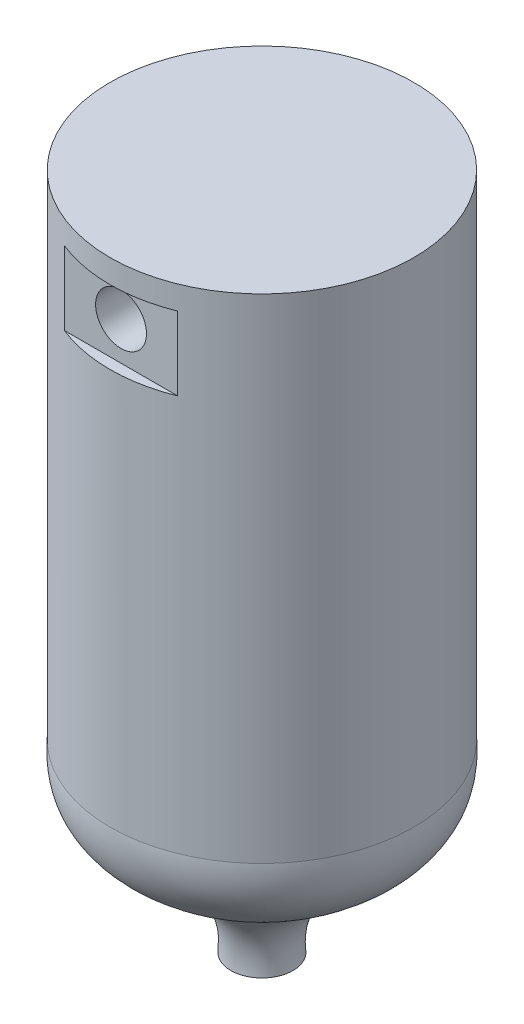
ISO-10303-21;
HEADER;
FILE_DESCRIPTION(('STEP AP214'),'2;1');
FILE_NAME('part.step','',(''),(''),'','','');
FILE_SCHEMA(('AUTOMOTIVE_DESIGN { 1 0 10303 214 1 1 1 1 }'));
ENDSEC;
DATA;
#1=APPLICATION_CONTEXT('core data for automotive mechanical design processes');
#2=APPLICATION_PROTOCOL_DEFINITION('international standard','automotive_design',2000,#1);
#3=PRODUCT_CONTEXT('',#1,'mechanical');
#4=PRODUCT('Part','Part','',(#3));
#5=PRODUCT_RELATED_PRODUCT_CATEGORY('part','',(#4));
#6=PRODUCT_DEFINITION_FORMATION('','',#4);
#7=PRODUCT_DEFINITION_CONTEXT('part definition',#1,'design');
#8=PRODUCT_DEFINITION('design','',#6,#7);
#9=PRODUCT_DEFINITION_SHAPE('','',#8);
#10=(LENGTH_UNIT() NAMED_UNIT(*) SI_UNIT(.MILLI.,.METRE.));
#11=(NAMED_UNIT(*) PLANE_ANGLE_UNIT() SI_UNIT($,.RADIAN.));
#12=(NAMED_UNIT(*) SI_UNIT($,.STERADIAN.) SOLID_ANGLE_UNIT());
#13=UNCERTAINTY_MEASURE_WITH_UNIT(LENGTH_MEASURE(1.E-05),#10,'distance_accuracy_value','');
#14=(GEOMETRIC_REPRESENTATION_CONTEXT(3) GLOBAL_UNCERTAINTY_ASSIGNED_CONTEXT((#13)) GLOBAL_UNIT_ASSIGNED_CONTEXT((#10,
#11,#12)) REPRESENTATION_CONTEXT('',''));
#15=CARTESIAN_POINT('',(0.,0.,0.));
#16=DIRECTION('',(0.,0.,1.));
#17=DIRECTION('',(1.,0.,0.));
#18=AXIS2_PLACEMENT_3D('',#15,#16,#17);
#19=CARTESIAN_POINT('',(0.,0.,0.));
#20=DIRECTION('',(0.,1.,0.));
#21=DIRECTION('',(0.,0.,1.));
#22=AXIS2_PLACEMENT_3D('',#19,#20,#21);
#23=CYLINDRICAL_SURFACE('',#22,3.87911139565885);
#24=CARTESIAN_POINT('',(-0.65,-1.5,-3.82426531766957));
#25=CARTESIAN_POINT('',(-0.649998546176578,-1.53623473371001,-3.82426597421118));
#26=CARTESIAN_POINT('',(-0.646959839982097,-1.5724891832765,-3.82478588320797));
#27=CARTESIAN_POINT('',(-0.634890704729489,-1.64398064009959,-3.82680741958481));
#28=CARTESIAN_POINT('',(-0.625854768136324,-1.67921668103609,-3.82830994933251));
#29=CARTESIAN_POINT('',(-0.602072361174586,-1.74762634232507,-3.83212188225558));
#30=CARTESIAN_POINT('',(-0.587330685552948,-1.78080166728235,-3.83443060779544));
#31=CARTESIAN_POINT('',(-0.552567234311796,-1.84420451847038,-3.83959399553368));
#32=CARTESIAN_POINT('',(-0.532546045399725,-1.87443237173998,-3.84244859705967));
#33=CARTESIAN_POINT('',(-0.487579135023968,-1.93138691220626,-3.84841387152831));
#34=CARTESIAN_POINT('',(-0.462591092558456,-1.95807997521595,-3.85152660092203));
#35=CARTESIAN_POINT('',(-0.408491251125715,-2.0069151286747,-3.85763914063868));
#36=CARTESIAN_POINT('',(-0.379379206890013,-2.02905694825366,-3.86063894423208));
#37=CARTESIAN_POINT('',(-0.317639762197346,-2.06828739288232,-3.8662094076632));
#38=CARTESIAN_POINT('',(-0.284992202508499,-2.08534470815015,-3.86877736772152));
#39=CARTESIAN_POINT('',(-0.217244981977225,-2.11372068228962,-3.87317191464372));
#40=CARTESIAN_POINT('',(-0.182145482450684,-2.1250397182853,-3.87499855022643));
#41=CARTESIAN_POINT('',(-0.11083815247847,-2.14151494195452,-3.87769011834452));
#42=CARTESIAN_POINT('',(-0.0746437147454618,-2.14672763225848,-3.8785638627805));
#43=CARTESIAN_POINT('',(-0.00188412118006963,-2.15101790919141,-3.87928148049109));
#44=CARTESIAN_POINT('',(0.0346810090221711,-2.15009591713017,-3.87912542448902));
#45=CARTESIAN_POINT('',(0.106757666444681,-2.14218703581793,-3.87780799655712));
#46=CARTESIAN_POINT('',(0.142276076778854,-2.13526095571873,-3.87665670466136));
#47=CARTESIAN_POINT('',(0.211639336783039,-2.11563627429322,-3.87348940750765));
#48=CARTESIAN_POINT('',(0.245484135016727,-2.10293749567252,-3.87147337569143));
#49=CARTESIAN_POINT('',(0.310720102129918,-2.07206755754787,-3.8667859737859));
#50=CARTESIAN_POINT('',(0.342099205212783,-2.0538713719186,-3.86411161730821));
#51=CARTESIAN_POINT('',(0.401381543998368,-2.0125414822751,-3.85840463427098));
#52=CARTESIAN_POINT('',(0.429284495121526,-1.98940737443176,-3.85537197841837));
#53=CARTESIAN_POINT('',(0.481181784451118,-1.9385211503054,-3.84924171525799));
#54=CARTESIAN_POINT('',(0.505123997622087,-1.91071588440319,-3.84614376750001));
#55=CARTESIAN_POINT('',(0.548011596283445,-1.85145563228404,-3.84026802874931));
#56=CARTESIAN_POINT('',(0.566956934711448,-1.82000061169641,-3.83749024077211));
#57=CARTESIAN_POINT('',(0.59932343229095,-1.75427293543053,-3.83256914548439));
#58=CARTESIAN_POINT('',(0.612738262213018,-1.71999710505323,-3.8304265659026));
#59=CARTESIAN_POINT('',(0.633605346199086,-1.64963461682606,-3.82703048537092));
#60=CARTESIAN_POINT('',(0.641058131300565,-1.61354812055598,-3.82577690523927));
#61=CARTESIAN_POINT('',(0.649716058915203,-1.54105519312155,-3.82431609196514));
#62=CARTESIAN_POINT('',(0.650995530089509,-1.50465788188375,-3.82409641114238));
#63=CARTESIAN_POINT('',(0.647468632171978,-1.43216918617923,-3.82469510794848));
#64=CARTESIAN_POINT('',(0.642662500792468,-1.39607778981846,-3.82551344503088));
#65=CARTESIAN_POINT('',(0.627164216746416,-1.32546187391059,-3.82808446713303));
#66=CARTESIAN_POINT('',(0.616509944555507,-1.29092880222565,-3.82983113672897));
#67=CARTESIAN_POINT('',(0.589657562320541,-1.22413826902969,-3.83405696439789));
#68=CARTESIAN_POINT('',(0.573459117414842,-1.19188094511318,-3.83653616671377));
#69=CARTESIAN_POINT('',(0.535802955875207,-1.13022690615426,-3.84197661496759));
#70=CARTESIAN_POINT('',(0.514297635171476,-1.10085965022917,-3.84494213773607));
#71=CARTESIAN_POINT('',(0.466703470604773,-1.04612403662627,-3.85100859694524));
#72=CARTESIAN_POINT('',(0.440614300737223,-1.02075596361505,-3.85410954300549));
#73=CARTESIAN_POINT('',(0.384263596041511,-0.974467147017902,-3.86013684859037));
#74=CARTESIAN_POINT('',(0.353961060199368,-0.95359599000505,-3.86306102861043));
#75=CARTESIAN_POINT('',(0.290236629098992,-0.917240896396043,-3.86837028889656));
#76=CARTESIAN_POINT('',(0.256814835626906,-0.901756784090276,-3.87075538674502));
#77=CARTESIAN_POINT('',(0.187947500666159,-0.876692360808176,-3.87470827765538));
#78=CARTESIAN_POINT('',(0.152511593586471,-0.867086166794153,-3.87627964913628));
#79=CARTESIAN_POINT('',(0.0805010077226178,-0.853966950934267,-3.87844317038438));
#80=CARTESIAN_POINT('',(0.0439264239525057,-0.850453422080832,-3.87903540163158));
#81=CARTESIAN_POINT('',(-0.0288448197955339,-0.849633987644511,-3.87917274316738));
#82=CARTESIAN_POINT('',(-0.065040628603624,-0.852252657431067,-3.87873057638042));
#83=CARTESIAN_POINT('',(-0.136469124605742,-0.863460061871194,-3.87687479645365));
#84=CARTESIAN_POINT('',(-0.171701817334256,-0.872048762210858,-3.87546118889738));
#85=CARTESIAN_POINT('',(-0.240174698817801,-0.894923364312018,-3.8718208257365));
#86=CARTESIAN_POINT('',(-0.27341710438651,-0.909202786565537,-3.86959499517873));
#87=CARTESIAN_POINT('',(-0.337045844962254,-0.943045067938054,-3.86457308340457));
#88=CARTESIAN_POINT('',(-0.367432042124925,-0.96260818187864,-3.86177697468642));
#89=CARTESIAN_POINT('',(-0.424865594236063,-1.00672958960788,-3.85588364724219));
#90=CARTESIAN_POINT('',(-0.451870227296492,-1.03134308560145,-3.85278331758001));
#91=CARTESIAN_POINT('',(-0.501392558411011,-1.08475077605094,-3.84665243719653));
#92=CARTESIAN_POINT('',(-0.523909204011142,-1.11354594839926,-3.8436219029896));
#93=CARTESIAN_POINT('',(-0.56396465040941,-1.17474445534734,-3.83795029257064));
#94=CARTESIAN_POINT('',(-0.581466661720417,-1.20717214444206,-3.83531215973278));
#95=CARTESIAN_POINT('',(-0.610748083636937,-1.27453835627387,-3.83075886050394));
#96=CARTESIAN_POINT('',(-0.62253319835938,-1.30947433619423,-3.82884297390852));
#97=CARTESIAN_POINT('',(-0.637493507166445,-1.37045422319241,-3.82637495290772));
#98=CARTESIAN_POINT('',(-0.642175896650694,-1.39612937215403,-3.82558825072897));
#99=CARTESIAN_POINT('',(-0.648429637356514,-1.4478662830633,-3.82453320169885));
#100=CARTESIAN_POINT('',(-0.650001046068933,-1.4739280378575,-3.82426484526847));
#101=CARTESIAN_POINT('',(-0.65,-1.5,-3.82426531766957));
#102=B_SPLINE_CURVE_WITH_KNOTS('',3,(#24,#25,#26,#27,#28,#29,#30,#31,#32,#33,#34,#35,#36,#37,
#38,#39,#40,#41,#42,#43,#44,#45,#46,#47,#48,#49,#50,#51,#52,#53,#54,#55,#56,#57,#58,#59,#60,#61,
#62,#63,#64,#65,#66,#67,#68,#69,#70,#71,#72,#73,#74,#75,#76,#77,#78,#79,#80,#81,#82,#83,#84,#85,
#86,#87,#88,#89,#90,#91,#92,#93,#94,#95,#96,#97,#98,#99,#100,#101),.UNSPECIFIED.,.T.,.F.,(4,2,2,
2,2,2,2,2,2,2,2,2,2,2,2,2,2,2,2,2,2,2,2,2,2,2,2,2,2,2,2,2,2,2,2,2,2,2,4),(0.,0.108608857730518,
0.21731759427881,0.325935176437261,0.434540693107146,0.544114666275385,0.653695158920189,
0.763937120614878,0.874171836184982,0.983378273650201,1.09257721125403,1.2006829391961,
1.30879198756683,1.41740079799347,1.52601849398249,1.63596811289193,1.74591876730993,
1.85599490457998,1.96606123631073,2.07479896994673,2.18353245626258,2.29156980913198,
2.39961368848482,2.5086644211308,2.61772291263577,2.72792854999,2.83813059242224,
2.94784380777978,3.05754789279791,3.16590974263105,3.27427096963861,3.382509166465,
3.49075258432957,3.60024901689767,3.70977109675673,3.82007722636633,3.9302730688868,
4.00842179711966,4.08656908115248),.UNSPECIFIED.);
#103=CARTESIAN_POINT('',(-0.65,-1.5,-3.82426531766957));
#104=VERTEX_POINT('',#103);
#105=EDGE_CURVE('E77',#104,#104,#102,.T.);
#106=ORIENTED_EDGE('',*,*,#105,.T.);
#107=EDGE_LOOP('',(#106));
#108=FACE_BOUND('',#107,.T.);
#109=CARTESIAN_POINT('',(0.,-12.6027502968154,0.));
#110=DIRECTION('',(0.,1.,0.));
#111=DIRECTION('',(0.,0.,1.));
#112=AXIS2_PLACEMENT_3D('',#109,#110,#111);
#113=CIRCLE('',#112,3.87911140215357);
#114=CARTESIAN_POINT('',(0.,-12.6027502968154,3.87911140215357));
#115=VERTEX_POINT('',#114);
#116=EDGE_CURVE('E119',#115,#115,#113,.T.);
#117=ORIENTED_EDGE('',*,*,#116,.T.);
#118=EDGE_LOOP('',(#117));
#119=FACE_BOUND('',#118,.T.);
#120=CARTESIAN_POINT('',(0.,0.,0.));
#121=DIRECTION('',(0.,1.,0.));
#122=DIRECTION('',(0.,0.,1.));
#123=AXIS2_PLACEMENT_3D('',#120,#121,#122);
#124=CIRCLE('',#123,3.87911139565885);
#125=CARTESIAN_POINT('',(0.,0.,3.87911139565885));
#126=VERTEX_POINT('',#125);
#127=EDGE_CURVE('E84',#126,#126,#124,.T.);
#128=ORIENTED_EDGE('',*,*,#127,.F.);
#129=EDGE_LOOP('',(#128));
#130=FACE_BOUND('',#129,.T.);
#131=DIRECTION('',(0.,1.,0.));
#132=VECTOR('',#131,1.);
#133=CARTESIAN_POINT('',(1.44545064489807,0.,3.59974688736501));
#134=LINE('',#133,#132);
#135=CARTESIAN_POINT('',(1.44545064489807,-0.59983719010951,3.59974688736501));
#136=VERTEX_POINT('',#135);
#137=CARTESIAN_POINT('',(1.44545064489807,-2.47625754011222,3.59974688736501));
#138=VERTEX_POINT('',#137);
#139=EDGE_CURVE('E70',#136,#138,#134,.F.);
#140=ORIENTED_EDGE('',*,*,#139,.T.);
#141=CARTESIAN_POINT('',(0.,-2.47625754011222,0.));
#142=DIRECTION('',(0.,1.,0.));
#143=DIRECTION('',(0.,0.,1.));
#144=AXIS2_PLACEMENT_3D('',#141,#142,#143);
#145=CIRCLE('',#144,3.87911139565885);
#146=CARTESIAN_POINT('',(-1.44545064489807,-2.47625754011222,3.59974688736501));
#147=VERTEX_POINT('',#146);
#148=EDGE_CURVE('E11',#138,#147,#145,.F.);
#149=ORIENTED_EDGE('',*,*,#148,.T.);
#150=DIRECTION('',(0.,1.,0.));
#151=VECTOR('',#150,1.);
#152=CARTESIAN_POINT('',(-1.44545064489807,0.,3.59974688736501));
#153=LINE('',#152,#151);
#154=CARTESIAN_POINT('',(-1.44545064489807,-0.59983719010951,3.59974688736501));
#155=VERTEX_POINT('',#154);
#156=EDGE_CURVE('E71',#147,#155,#153,.T.);
#157=ORIENTED_EDGE('',*,*,#156,.T.);
#158=CARTESIAN_POINT('',(0.,-0.59983719010951,0.));
#159=DIRECTION('',(0.,-1.,0.));
#160=DIRECTION('',(0.,0.,-1.));
#161=AXIS2_PLACEMENT_3D('',#158,#159,#160);
#162=CIRCLE('',#161,3.87911139565885);
#163=EDGE_CURVE('E44',#155,#136,#162,.F.);
#164=ORIENTED_EDGE('',*,*,#163,.T.);
#165=EDGE_LOOP('',(#140,#149,#157,#164));
#166=FACE_BOUND('',#165,.T.);
#167=ADVANCED_FACE('F36',(#108,#119,#130,#166),#23,.T.);
#168=CARTESIAN_POINT('',(-3.87911139565885,0.,0.));
#169=DIRECTION('',(0.,1.,0.));
#170=DIRECTION('',(0.,0.,1.));
#171=AXIS2_PLACEMENT_3D('',#168,#169,#170);
#172=PLANE('',#171);
#173=ORIENTED_EDGE('',*,*,#127,.T.);
#174=EDGE_LOOP('',(#173));
#175=FACE_BOUND('',#174,.T.);
#176=ADVANCED_FACE('F38',(#175),#172,.T.);
#177=CARTESIAN_POINT('',(-0.795067133024361,-17.316571149834,0.));
#178=DIRECTION('',(0.,-1.,0.));
#179=DIRECTION('',(0.,0.,-1.));
#180=AXIS2_PLACEMENT_3D('',#177,#178,#179);
#181=PLANE('',#180);
#182=CARTESIAN_POINT('',(0.,-17.316571149834,0.));
#183=DIRECTION('',(0.,1.,0.));
#184=DIRECTION('',(0.,0.,1.));
#185=AXIS2_PLACEMENT_3D('',#182,#183,#184);
#186=CIRCLE('',#185,0.795067133024361);
#187=CARTESIAN_POINT('',(0.,-17.316571149834,0.795067133024361));
#188=VERTEX_POINT('',#187);
#189=EDGE_CURVE('E122',#188,#188,#186,.T.);
#190=ORIENTED_EDGE('',*,*,#189,.F.);
#191=EDGE_LOOP('',(#190));
#192=FACE_BOUND('',#191,.T.);
#193=ADVANCED_FACE('F98',(#192),#181,.T.);
#194=CARTESIAN_POINT('',(-3.87911140215357,-12.6027502968154,0.));
#195=CARTESIAN_POINT('',(-4.09623859330577,-15.2491800405902,0.));
#196=CARTESIAN_POINT('',(-0.537349983631471,-14.7278090992826,0.));
#197=CARTESIAN_POINT('',(-0.795067133024361,-17.316571149834,0.));
#198=B_SPLINE_CURVE_WITH_KNOTS('',3,(#194,#195,#196,#197),.UNSPECIFIED.,.F.,.F.,(4,4),(0.,1.),.UNSPECIFIED.);
#199=CARTESIAN_POINT('',(0.,0.,0.));
#200=DIRECTION('',(0.,1.,0.));
#201=AXIS1_PLACEMENT('',#199,#200);
#202=SURFACE_OF_REVOLUTION('',#198,#201);
#203=ORIENTED_EDGE('',*,*,#189,.T.);
#204=EDGE_LOOP('',(#203));
#205=FACE_BOUND('',#204,.T.);
#206=ORIENTED_EDGE('',*,*,#116,.F.);
#207=EDGE_LOOP('',(#206));
#208=FACE_BOUND('',#207,.T.);
#209=ADVANCED_FACE('F94',(#205,#208),#202,.F.);
#210=CARTESIAN_POINT('',(0.,-1.5,-1.9));
#211=DIRECTION('',(0.,0.,-1.));
#212=DIRECTION('',(-1.,0.,0.));
#213=AXIS2_PLACEMENT_3D('',#210,#211,#212);
#214=CYLINDRICAL_SURFACE('',#213,0.65);
#215=ORIENTED_EDGE('',*,*,#105,.F.);
#216=EDGE_LOOP('',(#215));
#217=FACE_BOUND('',#216,.T.);
#218=CARTESIAN_POINT('',(0.,-1.5,-1.9));
#219=DIRECTION('',(0.,0.,1.));
#220=DIRECTION('',(1.,0.,0.));
#221=AXIS2_PLACEMENT_3D('',#218,#219,#220);
#222=CIRCLE('',#221,0.65);
#223=CARTESIAN_POINT('',(0.65,-1.5,-1.9));
#224=VERTEX_POINT('',#223);
#225=EDGE_CURVE('E74',#224,#224,#222,.T.);
#226=ORIENTED_EDGE('',*,*,#225,.T.);
#227=EDGE_LOOP('',(#226));
#228=FACE_BOUND('',#227,.T.);
#229=ADVANCED_FACE('F97',(#217,#228),#214,.F.);
#230=CARTESIAN_POINT('',(0.,-1.5,-1.9));
#231=DIRECTION('',(0.,0.,1.));
#232=DIRECTION('',(1.,0.,0.));
#233=AXIS2_PLACEMENT_3D('',#230,#231,#232);
#234=PLANE('',#233);
#235=ORIENTED_EDGE('',*,*,#225,.F.);
#236=EDGE_LOOP('',(#235));
#237=FACE_BOUND('',#236,.T.);
#238=ADVANCED_FACE('F135',(#237),#234,.F.);
#239=CARTESIAN_POINT('',(5.,-2.47625754011222,3.59974688736501));
#240=DIRECTION('',(0.,0.,1.));
#241=DIRECTION('',(1.,0.,0.));
#242=AXIS2_PLACEMENT_3D('',#239,#240,#241);
#243=PLANE('',#242);
#244=DIRECTION('',(-1.,0.,0.));
#245=VECTOR('',#244,1.);
#246=CARTESIAN_POINT('',(5.,-0.59983719010951,3.59974688736501));
#247=LINE('',#246,#245);
#248=EDGE_CURVE('E50',#136,#155,#247,.T.);
#249=ORIENTED_EDGE('',*,*,#248,.T.);
#250=ORIENTED_EDGE('',*,*,#156,.F.);
#251=DIRECTION('',(-1.,0.,0.));
#252=VECTOR('',#251,1.);
#253=CARTESIAN_POINT('',(5.,-2.47625754011222,3.59974688736501));
#254=LINE('',#253,#252);
#255=EDGE_CURVE('E63',#138,#147,#254,.T.);
#256=ORIENTED_EDGE('',*,*,#255,.F.);
#257=ORIENTED_EDGE('',*,*,#139,.F.);
#258=EDGE_LOOP('',(#249,#250,#256,#257));
#259=FACE_BOUND('',#258,.T.);
#260=CARTESIAN_POINT('',(0.,-1.5,3.59974688736501));
#261=DIRECTION('',(0.,0.,1.));
#262=DIRECTION('',(1.,0.,0.));
#263=AXIS2_PLACEMENT_3D('',#260,#261,#262);
#264=CIRCLE('',#263,0.65);
#265=CARTESIAN_POINT('',(0.65,-1.5,3.59974688736501));
#266=VERTEX_POINT('',#265);
#267=EDGE_CURVE('E72',#266,#266,#264,.F.);
#268=ORIENTED_EDGE('',*,*,#267,.T.);
#269=EDGE_LOOP('',(#268));
#270=FACE_BOUND('',#269,.T.);
#271=ADVANCED_FACE('F68',(#259,#270),#243,.T.);
#272=CARTESIAN_POINT('',(5.,-2.47625754011222,4.17038191177982));
#273=DIRECTION('',(0.,1.,0.));
#274=DIRECTION('',(0.,0.,1.));
#275=AXIS2_PLACEMENT_3D('',#272,#273,#274);
#276=PLANE('',#275);
#277=ORIENTED_EDGE('',*,*,#255,.T.);
#278=ORIENTED_EDGE('',*,*,#148,.F.);
#279=EDGE_LOOP('',(#277,#278));
#280=FACE_BOUND('',#279,.T.);
#281=ADVANCED_FACE('F62',(#280),#276,.T.);
#282=CARTESIAN_POINT('',(5.,-0.59983719010951,3.59974688736501));
#283=DIRECTION('',(0.,-1.,0.));
#284=DIRECTION('',(0.,0.,-1.));
#285=AXIS2_PLACEMENT_3D('',#282,#283,#284);
#286=PLANE('',#285);
#287=ORIENTED_EDGE('',*,*,#248,.F.);
#288=ORIENTED_EDGE('',*,*,#163,.F.);
#289=EDGE_LOOP('',(#287,#288));
#290=FACE_BOUND('',#289,.T.);
#291=ADVANCED_FACE('F141',(#290),#286,.T.);
#292=CARTESIAN_POINT('',(0.,-1.5,1.9));
#293=DIRECTION('',(0.,0.,1.));
#294=DIRECTION('',(1.,0.,0.));
#295=AXIS2_PLACEMENT_3D('',#292,#293,#294);
#296=PLANE('',#295);
#297=CARTESIAN_POINT('',(0.,-1.5,1.9));
#298=DIRECTION('',(0.,0.,1.));
#299=DIRECTION('',(1.,0.,0.));
#300=AXIS2_PLACEMENT_3D('',#297,#298,#299);
#301=CIRCLE('',#300,0.65);
#302=CARTESIAN_POINT('',(0.65,-1.5,1.9));
#303=VERTEX_POINT('',#302);
#304=EDGE_CURVE('E81',#303,#303,#301,.T.);
#305=ORIENTED_EDGE('',*,*,#304,.T.);
#306=EDGE_LOOP('',(#305));
#307=FACE_BOUND('',#306,.T.);
#308=ADVANCED_FACE('F138',(#307),#296,.T.);
#309=CARTESIAN_POINT('',(0.,-1.5,1.9));
#310=DIRECTION('',(0.,0.,1.));
#311=DIRECTION('',(1.,0.,0.));
#312=AXIS2_PLACEMENT_3D('',#309,#310,#311);
#313=CYLINDRICAL_SURFACE('',#312,0.65);
#314=ORIENTED_EDGE('',*,*,#304,.F.);
#315=EDGE_LOOP('',(#314));
#316=FACE_BOUND('',#315,.T.);
#317=ORIENTED_EDGE('',*,*,#267,.F.);
#318=EDGE_LOOP('',(#317));
#319=FACE_BOUND('',#318,.T.);
#320=ADVANCED_FACE('F140',(#316,#319),#313,.F.);
#321=CLOSED_SHELL('',(#167,#176,#193,#209,#229,#238,#271,#281,#291,#308,#320));
#322=MANIFOLD_SOLID_BREP('B2',#321);
#323=ADVANCED_BREP_SHAPE_REPRESENTATION('',(#18,#322),#14);
#324=SHAPE_DEFINITION_REPRESENTATION(#9,#323);
ENDSEC;
END-ISO-10303-21;
